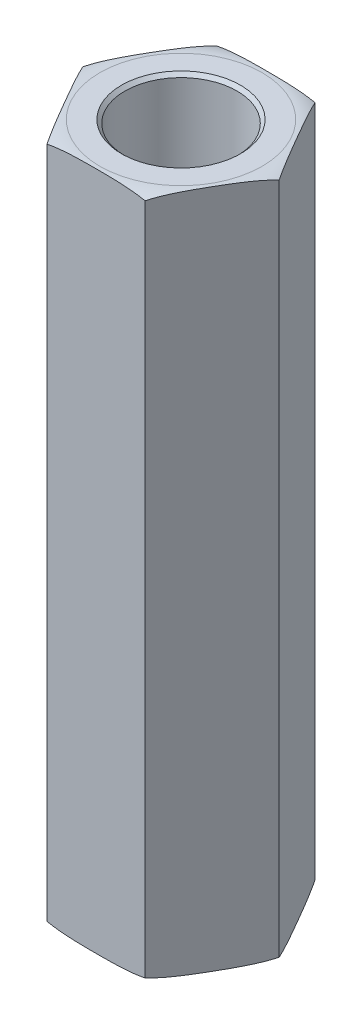
ISO-10303-21;
HEADER;
FILE_DESCRIPTION(('STEP AP214'),'2;1');
FILE_NAME('part.step','',(''),(''),'','','');
FILE_SCHEMA(('AUTOMOTIVE_DESIGN { 1 0 10303 214 1 1 1 1 }'));
ENDSEC;
DATA;
#1=APPLICATION_CONTEXT('core data for automotive mechanical design processes');
#2=APPLICATION_PROTOCOL_DEFINITION('international standard','automotive_design',2000,#1);
#3=PRODUCT_CONTEXT('',#1,'mechanical');
#4=PRODUCT('Part','Part','',(#3));
#5=PRODUCT_RELATED_PRODUCT_CATEGORY('part','',(#4));
#6=PRODUCT_DEFINITION_FORMATION('','',#4);
#7=PRODUCT_DEFINITION_CONTEXT('part definition',#1,'design');
#8=PRODUCT_DEFINITION('design','',#6,#7);
#9=PRODUCT_DEFINITION_SHAPE('','',#8);
#10=(LENGTH_UNIT() NAMED_UNIT(*) SI_UNIT(.MILLI.,.METRE.));
#11=(NAMED_UNIT(*) PLANE_ANGLE_UNIT() SI_UNIT($,.RADIAN.));
#12=(NAMED_UNIT(*) SI_UNIT($,.STERADIAN.) SOLID_ANGLE_UNIT());
#13=UNCERTAINTY_MEASURE_WITH_UNIT(LENGTH_MEASURE(1.E-05),#10,'distance_accuracy_value','');
#14=(GEOMETRIC_REPRESENTATION_CONTEXT(3) GLOBAL_UNCERTAINTY_ASSIGNED_CONTEXT((#13)) GLOBAL_UNIT_ASSIGNED_CONTEXT((#10,
#11,#12)) REPRESENTATION_CONTEXT('',''));
#15=CARTESIAN_POINT('',(0.,0.,0.));
#16=DIRECTION('',(0.,0.,1.));
#17=DIRECTION('',(1.,0.,0.));
#18=AXIS2_PLACEMENT_3D('',#15,#16,#17);
#19=CARTESIAN_POINT('',(3.66617420935412,12.7,0.));
#20=DIRECTION('',(-0.866025403784439,0.,0.5));
#21=DIRECTION('',(0.5,0.,0.866025403784439));
#22=AXIS2_PLACEMENT_3D('',#19,#20,#21);
#23=PLANE('',#22);
#24=DIRECTION('',(0.,1.,0.));
#25=VECTOR('',#24,1.);
#26=CARTESIAN_POINT('',(1.83308710467704,12.7,-3.175));
#27=LINE('',#26,#25);
#28=CARTESIAN_POINT('',(1.83308710467705,-12.573,-3.175));
#29=VERTEX_POINT('',#28);
#30=CARTESIAN_POINT('',(1.83308710467706,12.573,-3.175));
#31=VERTEX_POINT('',#30);
#32=EDGE_CURVE('E143',#29,#31,#27,.T.);
#33=ORIENTED_EDGE('',*,*,#32,.T.);
#34=CARTESIAN_POINT('',(3.66617420935412,12.573,0.));
#35=CARTESIAN_POINT('',(3.62797961467394,12.5889014148997,-0.0661549785605585));
#36=CARTESIAN_POINT('',(3.58956810864157,12.6024886076105,-0.132685658603878));
#37=CARTESIAN_POINT('',(3.5124905179571,12.6258161979402,-0.266187961794366));
#38=CARTESIAN_POINT('',(3.47382473049846,12.6355604771397,-0.333159070187399));
#39=CARTESIAN_POINT('',(3.39641631867872,12.6519966530451,-0.467234372392395));
#40=CARTESIAN_POINT('',(3.35767399633311,12.6586945328669,-0.534338043098201));
#41=CARTESIAN_POINT('',(3.28009834620112,12.6697767572932,-0.668703010557003));
#42=CARTESIAN_POINT('',(3.2412649958777,12.674160450474,-0.735964346345292));
#43=CARTESIAN_POINT('',(3.16354065964313,12.6812403004263,-0.870586845688127));
#44=CARTESIAN_POINT('',(3.12464965374474,12.6839355237591,-0.9379480438616));
#45=CARTESIAN_POINT('',(3.04685144594591,12.6881531983713,-1.07269849250698));
#46=CARTESIAN_POINT('',(3.00794424351967,12.6896756080272,-1.14008774388959));
#47=CARTESIAN_POINT('',(2.93051517598871,12.691922705889,-1.2741988228359));
#48=CARTESIAN_POINT('',(2.89199336248932,12.6926552468181,-1.34092056101654));
#49=CARTESIAN_POINT('',(2.8149477834614,12.6935767302574,-1.47436741839144));
#50=CARTESIAN_POINT('',(2.77642401791436,12.6937656658949,-1.5410925376178));
#51=CARTESIAN_POINT('',(2.69935964431009,12.6936659966806,-1.67457194815386));
#52=CARTESIAN_POINT('',(2.66081903631818,12.6933771811766,-1.74132623935045));
#53=CARTESIAN_POINT('',(2.58373908085326,12.692221986219,-1.87483263846084));
#54=CARTESIAN_POINT('',(2.54519973341241,12.6913555970386,-1.94158474631893));
#55=CARTESIAN_POINT('',(2.46812969629766,12.6887861940656,-2.0750739663429));
#56=CARTESIAN_POINT('',(2.42959900625961,12.6870832271617,-2.1418110791395));
#57=CARTESIAN_POINT('',(2.35255651340904,12.6824387229726,-2.27525259109845));
#58=CARTESIAN_POINT('',(2.31404470975438,12.6794972471358,-2.34195699171943));
#59=CARTESIAN_POINT('',(2.2508420623994,12.6732174124749,-2.45142718811111));
#60=CARTESIAN_POINT('',(2.22613849337005,12.6703980110463,-2.49421502479823));
#61=CARTESIAN_POINT('',(2.17676945272224,12.6638696794304,-2.57972471152118));
#62=CARTESIAN_POINT('',(2.1521039703418,12.6601610809139,-2.6224465801973));
#63=CARTESIAN_POINT('',(2.10282753811693,12.6516802711497,-2.7077958644265));
#64=CARTESIAN_POINT('',(2.07821657107526,12.6469084657008,-2.75042330976607));
#65=CARTESIAN_POINT('',(2.02900094683547,12.6360987712516,-2.8356672714756));
#66=CARTESIAN_POINT('',(2.00439646085461,12.6300577313084,-2.87828349128856));
#67=CARTESIAN_POINT('',(1.95527325900932,12.6165138354161,-2.96336737271507));
#68=CARTESIAN_POINT('',(1.93075459617613,12.609010197803,-3.00583494247581));
#69=CARTESIAN_POINT('',(1.8818215737317,12.5923203507084,-3.09058942351746));
#70=CARTESIAN_POINT('',(1.85740744053269,12.5831314978033,-3.13287594264091));
#71=CARTESIAN_POINT('',(1.83308710467706,12.573,-3.175));
#72=B_SPLINE_CURVE_WITH_KNOTS('',3,(#34,#35,#36,#37,#38,#39,#40,#41,#42,#43,#44,#45,#46,#47,#48,
#49,#50,#51,#52,#53,#54,#55,#56,#57,#58,#59,#60,#61,#62,#63,#64,#65,#66,#67,#68,#69,#70,#71),
.UNSPECIFIED.,.F.,.F.,(4,2,2,2,2,2,2,2,2,2,2,2,2,2,2,2,2,2,4),(0.,0.233977307817949,
0.467717675040708,0.700996973557522,0.934341903229779,1.16781571967243,1.40129782179829,
1.63243665809675,1.86357841666623,2.09482211846301,2.32606971471502,2.55730435147406,
2.78852751694422,2.93698369265095,3.0853845800448,3.23372892334589,3.38244598546616,
3.53124274626086,3.68027493713586),.UNSPECIFIED.);
#73=CARTESIAN_POINT('',(3.66617420935412,12.573,0.));
#74=VERTEX_POINT('',#73);
#75=EDGE_CURVE('E95',#74,#31,#72,.T.);
#76=ORIENTED_EDGE('',*,*,#75,.F.);
#77=DIRECTION('',(0.,1.,0.));
#78=VECTOR('',#77,1.);
#79=CARTESIAN_POINT('',(3.66617420935412,12.7,0.));
#80=LINE('',#79,#78);
#81=CARTESIAN_POINT('',(3.66617420935412,-12.573,0.));
#82=VERTEX_POINT('',#81);
#83=EDGE_CURVE('E145',#74,#82,#80,.F.);
#84=ORIENTED_EDGE('',*,*,#83,.T.);
#85=CARTESIAN_POINT('',(1.83308710467705,-12.573,-3.17500000000001));
#86=CARTESIAN_POINT('',(1.87128169935723,-12.5889014148997,-3.10884502143945));
#87=CARTESIAN_POINT('',(1.9096932053896,-12.6024886076105,-3.04231434139613));
#88=CARTESIAN_POINT('',(1.98677079607407,-12.6258161979402,-2.90881203820565));
#89=CARTESIAN_POINT('',(2.02543658353271,-12.6355604771397,-2.84184092981261));
#90=CARTESIAN_POINT('',(2.10284499535244,-12.6519966530451,-2.70776562760762));
#91=CARTESIAN_POINT('',(2.14158731769805,-12.6586945328669,-2.64066195690182));
#92=CARTESIAN_POINT('',(2.21916296783004,-12.6697767572932,-2.50629698944302));
#93=CARTESIAN_POINT('',(2.25799631815347,-12.674160450474,-2.43903565365473));
#94=CARTESIAN_POINT('',(2.33572065438803,-12.6812403004263,-2.3044131543119));
#95=CARTESIAN_POINT('',(2.37461166028642,-12.6839355237591,-2.23705195613842));
#96=CARTESIAN_POINT('',(2.45240986808525,-12.6881531983713,-2.10230150749305));
#97=CARTESIAN_POINT('',(2.49131707051149,-12.6896756080272,-2.03491225611044));
#98=CARTESIAN_POINT('',(2.56874613804245,-12.691922705889,-1.90080117716413));
#99=CARTESIAN_POINT('',(2.60726795154184,-12.6926552468181,-1.8340794389835));
#100=CARTESIAN_POINT('',(2.68431353056975,-12.6935767302574,-1.70063258160859));
#101=CARTESIAN_POINT('',(2.72283729611679,-12.6937656658949,-1.63390746238224));
#102=CARTESIAN_POINT('',(2.79990166972106,-12.6936659966806,-1.50042805184618));
#103=CARTESIAN_POINT('',(2.83844227771297,-12.6933771811766,-1.43367376064959));
#104=CARTESIAN_POINT('',(2.91552223317789,-12.692221986219,-1.30016736153921));
#105=CARTESIAN_POINT('',(2.95406158061874,-12.6913555970386,-1.23341525368111));
#106=CARTESIAN_POINT('',(3.03113161773348,-12.6887861940656,-1.09992603365715));
#107=CARTESIAN_POINT('',(3.06966230777154,-12.6870832271617,-1.03318892086055));
#108=CARTESIAN_POINT('',(3.14670480062211,-12.6824387229726,-0.899747408901607));
#109=CARTESIAN_POINT('',(3.18521660427677,-12.6794972471358,-0.833043008280621));
#110=CARTESIAN_POINT('',(3.24841925163175,-12.6732174124749,-0.723572811888938));
#111=CARTESIAN_POINT('',(3.27312282066109,-12.6703980110463,-0.680784975201824));
#112=CARTESIAN_POINT('',(3.32249186130891,-12.6638696794304,-0.595275288478867));
#113=CARTESIAN_POINT('',(3.34715734368935,-12.6601610809139,-0.552553419802744));
#114=CARTESIAN_POINT('',(3.39643377591423,-12.6516802711497,-0.467204135573539));
#115=CARTESIAN_POINT('',(3.4210447429559,-12.6469084657008,-0.424576690233965));
#116=CARTESIAN_POINT('',(3.47026036719569,-12.6360987712516,-0.339332728524428));
#117=CARTESIAN_POINT('',(3.49486485317655,-12.6300577313084,-0.296716508711459));
#118=CARTESIAN_POINT('',(3.54398805502185,-12.6165138354161,-0.211632627284942));
#119=CARTESIAN_POINT('',(3.56850671785504,-12.609010197803,-0.169165057524202));
#120=CARTESIAN_POINT('',(3.61743974029947,-12.5923203507084,-0.0844105764825456));
#121=CARTESIAN_POINT('',(3.64185387349848,-12.5831314978033,-0.0421240573590982));
#122=CARTESIAN_POINT('',(3.66617420935412,-12.573,0.));
#123=B_SPLINE_CURVE_WITH_KNOTS('',3,(#85,#86,#87,#88,#89,#90,#91,#92,#93,#94,#95,#96,#97,#98,
#99,#100,#101,#102,#103,#104,#105,#106,#107,#108,#109,#110,#111,#112,#113,#114,#115,#116,#117,
#118,#119,#120,#121,#122),.UNSPECIFIED.,.F.,.F.,(4,2,2,2,2,2,2,2,2,2,2,2,2,2,2,2,2,2,4),(0.,
0.233977307817944,0.467717675040699,0.700996973557508,0.934341903229761,1.16781571967241,
1.40129782179826,1.63243665809671,1.86357841666619,2.09482211846297,2.32606971471497,
2.55730435147401,2.78852751694416,2.9369836926509,3.08538458004476,3.23372892334587,
3.38244598546614,3.53124274626085,3.68027493713586),.UNSPECIFIED.);
#124=EDGE_CURVE('E223',#29,#82,#123,.T.);
#125=ORIENTED_EDGE('',*,*,#124,.F.);
#126=EDGE_LOOP('',(#33,#76,#84,#125));
#127=FACE_BOUND('',#126,.T.);
#128=ADVANCED_FACE('F15',(#127),#23,.F.);
#129=CARTESIAN_POINT('',(1.83308710467706,12.7,3.17499999999999));
#130=DIRECTION('',(-0.866025403784439,0.,-0.5));
#131=DIRECTION('',(-0.5,0.,0.866025403784439));
#132=AXIS2_PLACEMENT_3D('',#129,#130,#131);
#133=PLANE('',#132);
#134=ORIENTED_EDGE('',*,*,#83,.F.);
#135=CARTESIAN_POINT('',(1.83308710467706,12.573,3.17499999999999));
#136=CARTESIAN_POINT('',(1.87128169935724,12.5889014148997,3.10884502143943));
#137=CARTESIAN_POINT('',(1.90969320538962,12.6024886076105,3.04231434139611));
#138=CARTESIAN_POINT('',(1.98677079607408,12.6258161979402,2.90881203820562));
#139=CARTESIAN_POINT('',(2.02543658353273,12.6355604771397,2.84184092981259));
#140=CARTESIAN_POINT('',(2.10284499535246,12.6519966530451,2.7077656276076));
#141=CARTESIAN_POINT('',(2.14158731769807,12.6586945328669,2.64066195690179));
#142=CARTESIAN_POINT('',(2.21916296783006,12.6697767572932,2.50629698944299));
#143=CARTESIAN_POINT('',(2.25799631815349,12.674160450474,2.4390356536547));
#144=CARTESIAN_POINT('',(2.33572065438805,12.6812403004263,2.30441315431186));
#145=CARTESIAN_POINT('',(2.37461166028644,12.6839355237591,2.23705195613839));
#146=CARTESIAN_POINT('',(2.45240986808528,12.6881531983713,2.10230150749301));
#147=CARTESIAN_POINT('',(2.49131707051151,12.6896756080272,2.0349122561104));
#148=CARTESIAN_POINT('',(2.56874613804248,12.691922705889,1.90080117716409));
#149=CARTESIAN_POINT('',(2.60726795154187,12.6926552468181,1.83407943898345));
#150=CARTESIAN_POINT('',(2.68431353056978,12.6935767302574,1.70063258160855));
#151=CARTESIAN_POINT('',(2.72283729611682,12.6937656658949,1.63390746238219));
#152=CARTESIAN_POINT('',(2.79990166972109,12.6936659966806,1.50042805184613));
#153=CARTESIAN_POINT('',(2.83844227771301,12.6933771811766,1.43367376064954));
#154=CARTESIAN_POINT('',(2.91552223317792,12.692221986219,1.30016736153915));
#155=CARTESIAN_POINT('',(2.95406158061877,12.6913555970386,1.23341525368106));
#156=CARTESIAN_POINT('',(3.03113161773352,12.6887861940656,1.09992603365709));
#157=CARTESIAN_POINT('',(3.06966230777158,12.6870832271617,1.03318892086049));
#158=CARTESIAN_POINT('',(3.14670480062214,12.6824387229726,0.899747408901544));
#159=CARTESIAN_POINT('',(3.1852166042768,12.6794972471358,0.833043008280556));
#160=CARTESIAN_POINT('',(3.24841925163178,12.6732174124749,0.723572811888876));
#161=CARTESIAN_POINT('',(3.27312282066113,12.6703980110463,0.680784975201767));
#162=CARTESIAN_POINT('',(3.32249186130894,12.6638696794304,0.595275288478818));
#163=CARTESIAN_POINT('',(3.34715734368938,12.6601610809139,0.552553419802699));
#164=CARTESIAN_POINT('',(3.39643377591425,12.6516802711497,0.467204135573501));
#165=CARTESIAN_POINT('',(3.42104474295592,12.6469084657008,0.424576690233932));
#166=CARTESIAN_POINT('',(3.47026036719571,12.6360987712516,0.339332728524402));
#167=CARTESIAN_POINT('',(3.49486485317657,12.6300577313084,0.296716508711437));
#168=CARTESIAN_POINT('',(3.54398805502186,12.6165138354161,0.211632627284927));
#169=CARTESIAN_POINT('',(3.56850671785505,12.609010197803,0.169165057524192));
#170=CARTESIAN_POINT('',(3.61743974029947,12.5923203507084,0.0844105764825436));
#171=CARTESIAN_POINT('',(3.64185387349848,12.5831314978033,0.0421240573591002));
#172=CARTESIAN_POINT('',(3.66617420935412,12.573,0.));
#173=B_SPLINE_CURVE_WITH_KNOTS('',3,(#135,#136,#137,#138,#139,#140,#141,#142,#143,#144,#145,
#146,#147,#148,#149,#150,#151,#152,#153,#154,#155,#156,#157,#158,#159,#160,#161,#162,#163,#164,
#165,#166,#167,#168,#169,#170,#171,#172),.UNSPECIFIED.,.F.,.F.,(4,2,2,2,2,2,2,2,2,2,2,2,2,2,2,2,
2,2,4),(0.,0.23397730781795,0.467717675040709,0.700996973557522,0.93434190322978,
1.16781571967243,1.40129782179829,1.63243665809675,1.86357841666623,2.09482211846301,
2.32606971471502,2.55730435147406,2.78852751694422,2.93698369265095,3.08538458004479,
3.23372892334589,3.38244598546615,3.53124274626085,3.68027493713584),.UNSPECIFIED.);
#174=CARTESIAN_POINT('',(1.83308710467706,12.573,3.17499999999999));
#175=VERTEX_POINT('',#174);
#176=EDGE_CURVE('E216',#175,#74,#173,.T.);
#177=ORIENTED_EDGE('',*,*,#176,.F.);
#178=DIRECTION('',(0.,1.,0.));
#179=VECTOR('',#178,1.);
#180=CARTESIAN_POINT('',(1.83308710467706,12.7,3.17499999999999));
#181=LINE('',#180,#179);
#182=CARTESIAN_POINT('',(1.83308710467706,-12.573,3.17499999999999));
#183=VERTEX_POINT('',#182);
#184=EDGE_CURVE('E140',#175,#183,#181,.F.);
#185=ORIENTED_EDGE('',*,*,#184,.T.);
#186=CARTESIAN_POINT('',(3.66617420935412,-12.573,0.));
#187=CARTESIAN_POINT('',(3.62797961467394,-12.5889014148997,0.0661549785605638));
#188=CARTESIAN_POINT('',(3.58956810864156,-12.6024886076105,0.132685658603883));
#189=CARTESIAN_POINT('',(3.5124905179571,-12.6258161979402,0.266187961794371));
#190=CARTESIAN_POINT('',(3.47382473049846,-12.6355604771397,0.333159070187405));
#191=CARTESIAN_POINT('',(3.39641631867872,-12.6519966530451,0.467234372392401));
#192=CARTESIAN_POINT('',(3.35767399633311,-12.6586945328669,0.534338043098206));
#193=CARTESIAN_POINT('',(3.28009834620112,-12.6697767572932,0.668703010557008));
#194=CARTESIAN_POINT('',(3.2412649958777,-12.674160450474,0.735964346345298));
#195=CARTESIAN_POINT('',(3.16354065964313,-12.6812403004263,0.870586845688132));
#196=CARTESIAN_POINT('',(3.12464965374474,-12.6839355237591,0.937948043861606));
#197=CARTESIAN_POINT('',(3.0468514459459,-12.6881531983713,1.07269849250699));
#198=CARTESIAN_POINT('',(3.00794424351967,-12.6896756080272,1.1400877438896));
#199=CARTESIAN_POINT('',(2.9305151759887,-12.691922705889,1.27419882283591));
#200=CARTESIAN_POINT('',(2.89199336248931,-12.6926552468181,1.34092056101654));
#201=CARTESIAN_POINT('',(2.8149477834614,-12.6935767302574,1.47436741839145));
#202=CARTESIAN_POINT('',(2.77642401791436,-12.6937656658949,1.5410925376178));
#203=CARTESIAN_POINT('',(2.69935964431009,-12.6936659966806,1.67457194815387));
#204=CARTESIAN_POINT('',(2.66081903631818,-12.6933771811766,1.74132623935046));
#205=CARTESIAN_POINT('',(2.58373908085326,-12.692221986219,1.87483263846084));
#206=CARTESIAN_POINT('',(2.54519973341241,-12.6913555970386,1.94158474631894));
#207=CARTESIAN_POINT('',(2.46812969629766,-12.6887861940656,2.0750739663429));
#208=CARTESIAN_POINT('',(2.4295990062596,-12.6870832271616,2.14181107913951));
#209=CARTESIAN_POINT('',(2.35255651340904,-12.6824387229726,2.27525259109845));
#210=CARTESIAN_POINT('',(2.31404470975437,-12.6794972471358,2.34195699171944));
#211=CARTESIAN_POINT('',(2.2508420623994,-12.6732174124749,2.45142718811112));
#212=CARTESIAN_POINT('',(2.22613849337005,-12.6703980110463,2.49421502479823));
#213=CARTESIAN_POINT('',(2.17676945272224,-12.6638696794304,2.57972471152118));
#214=CARTESIAN_POINT('',(2.1521039703418,-12.6601610809139,2.6224465801973));
#215=CARTESIAN_POINT('',(2.10282753811693,-12.6516802711497,2.7077958644265));
#216=CARTESIAN_POINT('',(2.07821657107526,-12.6469084657008,2.75042330976606));
#217=CARTESIAN_POINT('',(2.02900094683548,-12.6360987712516,2.83566727147559));
#218=CARTESIAN_POINT('',(2.00439646085462,-12.6300577313084,2.87828349128856));
#219=CARTESIAN_POINT('',(1.95527325900932,-12.6165138354161,2.96336737271507));
#220=CARTESIAN_POINT('',(1.93075459617613,-12.609010197803,3.0058349424758));
#221=CARTESIAN_POINT('',(1.88182157373171,-12.5923203507084,3.09058942351745));
#222=CARTESIAN_POINT('',(1.8574074405327,-12.5831314978033,3.1328759426409));
#223=CARTESIAN_POINT('',(1.83308710467706,-12.573,3.17499999999999));
#224=B_SPLINE_CURVE_WITH_KNOTS('',3,(#186,#187,#188,#189,#190,#191,#192,#193,#194,#195,#196,
#197,#198,#199,#200,#201,#202,#203,#204,#205,#206,#207,#208,#209,#210,#211,#212,#213,#214,#215,
#216,#217,#218,#219,#220,#221,#222,#223),.UNSPECIFIED.,.F.,.F.,(4,2,2,2,2,2,2,2,2,2,2,2,2,2,2,2,
2,2,4),(0.,0.233977307817949,0.467717675040709,0.700996973557522,0.93434190322978,
1.16781571967243,1.40129782179829,1.63243665809675,1.86357841666623,2.09482211846301,
2.32606971471502,2.55730435147406,2.78852751694422,2.93698369265095,3.08538458004479,
3.23372892334589,3.38244598546615,3.53124274626085,3.68027493713584),.UNSPECIFIED.);
#225=EDGE_CURVE('E245',#82,#183,#224,.T.);
#226=ORIENTED_EDGE('',*,*,#225,.F.);
#227=EDGE_LOOP('',(#134,#177,#185,#226));
#228=FACE_BOUND('',#227,.T.);
#229=ADVANCED_FACE('F220',(#228),#133,.F.);
#230=CARTESIAN_POINT('',(1.83308710467706,12.7,-3.175));
#231=DIRECTION('',(0.,0.,1.));
#232=DIRECTION('',(1.,0.,0.));
#233=AXIS2_PLACEMENT_3D('',#230,#231,#232);
#234=PLANE('',#233);
#235=DIRECTION('',(0.,1.,0.));
#236=VECTOR('',#235,1.);
#237=CARTESIAN_POINT('',(-1.83308710467707,12.7,-3.175));
#238=LINE('',#237,#236);
#239=CARTESIAN_POINT('',(-1.83308710467707,-12.573,-3.175));
#240=VERTEX_POINT('',#239);
#241=CARTESIAN_POINT('',(-1.83308710467706,12.573,-3.17500000000001));
#242=VERTEX_POINT('',#241);
#243=EDGE_CURVE('E102',#240,#242,#238,.T.);
#244=ORIENTED_EDGE('',*,*,#243,.T.);
#245=CARTESIAN_POINT('',(1.83308710467706,12.573,-3.175));
#246=CARTESIAN_POINT('',(1.73237579828683,12.5939400141518,-3.175));
#247=CARTESIAN_POINT('',(1.63096506893486,12.6108853495327,-3.175));
#248=CARTESIAN_POINT('',(1.42767146651469,12.6384971643984,-3.175));
#249=CARTESIAN_POINT('',(1.32579191427254,12.6491875658753,-3.175));
#250=CARTESIAN_POINT('',(1.12177634709137,12.6661280408079,-3.175));
#251=CARTESIAN_POINT('',(1.0196405664338,12.6723812707189,-3.175));
#252=CARTESIAN_POINT('',(0.815663681397375,12.6819028064183,-3.175));
#253=CARTESIAN_POINT('',(0.713823115514573,12.6851834044999,-3.175));
#254=CARTESIAN_POINT('',(0.510018485441651,12.6899454848703,-3.175));
#255=CARTESIAN_POINT('',(0.408054390577976,12.6914254100882,-3.175));
#256=CARTESIAN_POINT('',(0.20406020033787,12.6933146818379,-3.175));
#257=CARTESIAN_POINT('',(0.102030100168935,12.6937234241492,-3.175));
#258=CARTESIAN_POINT('',(-0.102030100168934,12.6937234241492,-3.175));
#259=CARTESIAN_POINT('',(-0.204060200337869,12.6933146818379,-3.175));
#260=CARTESIAN_POINT('',(-0.408054390577974,12.6914254100882,-3.175));
#261=CARTESIAN_POINT('',(-0.510018485441649,12.6899454848703,-3.175));
#262=CARTESIAN_POINT('',(-0.71382311551457,12.6851834044999,-3.175));
#263=CARTESIAN_POINT('',(-0.815663681397372,12.6819028064183,-3.175));
#264=CARTESIAN_POINT('',(-1.01964056643379,12.6723812707189,-3.175));
#265=CARTESIAN_POINT('',(-1.12177634709137,12.6661280408079,-3.175));
#266=CARTESIAN_POINT('',(-1.32579191427253,12.6491875658753,-3.175));
#267=CARTESIAN_POINT('',(-1.42767146651468,12.6384971643984,-3.175));
#268=CARTESIAN_POINT('',(-1.63096506893485,12.6108853495327,-3.175));
#269=CARTESIAN_POINT('',(-1.73237579828682,12.5939400141518,-3.175));
#270=CARTESIAN_POINT('',(-1.83308710467705,12.573,-3.175));
#271=B_SPLINE_CURVE_WITH_KNOTS('',3,(#245,#246,#247,#248,#249,#250,#251,#252,#253,#254,#255,
#256,#257,#258,#259,#260,#261,#262,#263,#264,#265,#266,#267,#268,#269,#270),.UNSPECIFIED.,.F.,
.F.,(4,2,2,2,2,2,2,2,2,2,2,2,4),(0.,0.308333242342807,0.615479423308234,0.922406891130008,
1.2280592962085,1.53397581645216,1.84006485747889,2.14615389850561,2.45207041874927,
2.75772282382776,3.06465029164953,3.37179647261496,3.68012971495777),.UNSPECIFIED.);
#272=EDGE_CURVE('E87',#31,#242,#271,.T.);
#273=ORIENTED_EDGE('',*,*,#272,.F.);
#274=ORIENTED_EDGE('',*,*,#32,.F.);
#275=CARTESIAN_POINT('',(-1.83308710467707,-12.573,-3.175));
#276=CARTESIAN_POINT('',(-1.73237579828684,-12.5939400141518,-3.175));
#277=CARTESIAN_POINT('',(-1.63096506893487,-12.6108853495327,-3.175));
#278=CARTESIAN_POINT('',(-1.4276714665147,-12.6384971643984,-3.175));
#279=CARTESIAN_POINT('',(-1.32579191427255,-12.6491875658753,-3.175));
#280=CARTESIAN_POINT('',(-1.12177634709138,-12.6661280408079,-3.175));
#281=CARTESIAN_POINT('',(-1.0196405664338,-12.6723812707189,-3.175));
#282=CARTESIAN_POINT('',(-0.81566368139738,-12.6819028064183,-3.175));
#283=CARTESIAN_POINT('',(-0.713823115514577,-12.6851834044999,-3.175));
#284=CARTESIAN_POINT('',(-0.510018485441653,-12.6899454848703,-3.175));
#285=CARTESIAN_POINT('',(-0.408054390577979,-12.6914254100882,-3.175));
#286=CARTESIAN_POINT('',(-0.204060200337872,-12.6933146818379,-3.175));
#287=CARTESIAN_POINT('',(-0.102030100168936,-12.6937234241492,-3.175));
#288=CARTESIAN_POINT('',(0.102030100168934,-12.6937234241492,-3.175));
#289=CARTESIAN_POINT('',(0.204060200337868,-12.6933146818379,-3.175));
#290=CARTESIAN_POINT('',(0.408054390577973,-12.6914254100882,-3.175));
#291=CARTESIAN_POINT('',(0.510018485441647,-12.6899454848703,-3.175));
#292=CARTESIAN_POINT('',(0.713823115514568,-12.6851834044999,-3.175));
#293=CARTESIAN_POINT('',(0.81566368139737,-12.6819028064183,-3.175));
#294=CARTESIAN_POINT('',(1.01964056643379,-12.6723812707189,-3.175));
#295=CARTESIAN_POINT('',(1.12177634709137,-12.6661280408079,-3.175));
#296=CARTESIAN_POINT('',(1.32579191427253,-12.6491875658753,-3.175));
#297=CARTESIAN_POINT('',(1.42767146651468,-12.6384971643984,-3.175));
#298=CARTESIAN_POINT('',(1.63096506893485,-12.6108853495327,-3.175));
#299=CARTESIAN_POINT('',(1.73237579828682,-12.5939400141518,-3.175));
#300=CARTESIAN_POINT('',(1.83308710467705,-12.573,-3.175));
#301=B_SPLINE_CURVE_WITH_KNOTS('',3,(#275,#276,#277,#278,#279,#280,#281,#282,#283,#284,#285,
#286,#287,#288,#289,#290,#291,#292,#293,#294,#295,#296,#297,#298,#299,#300),.UNSPECIFIED.,.F.,
.F.,(4,2,2,2,2,2,2,2,2,2,2,2,4),(0.,0.308333242342808,0.615479423308238,0.922406891130013,
1.22805929620851,1.53397581645217,1.8400648574789,2.14615389850562,2.45207041874928,
2.75772282382777,3.06465029164954,3.37179647261497,3.68012971495777),.UNSPECIFIED.);
#302=EDGE_CURVE('E104',#240,#29,#301,.T.);
#303=ORIENTED_EDGE('',*,*,#302,.F.);
#304=EDGE_LOOP('',(#244,#273,#274,#303));
#305=FACE_BOUND('',#304,.T.);
#306=ADVANCED_FACE('F103',(#305),#234,.F.);
#307=CARTESIAN_POINT('',(-1.83308710467707,12.7,3.175));
#308=DIRECTION('',(0.,0.,-1.));
#309=DIRECTION('',(-1.,0.,0.));
#310=AXIS2_PLACEMENT_3D('',#307,#308,#309);
#311=PLANE('',#310);
#312=ORIENTED_EDGE('',*,*,#184,.F.);
#313=CARTESIAN_POINT('',(-1.83308710467706,12.573,3.175));
#314=CARTESIAN_POINT('',(-1.73237579828684,12.5939400141518,3.175));
#315=CARTESIAN_POINT('',(-1.63096506893486,12.6108853495327,3.175));
#316=CARTESIAN_POINT('',(-1.42767146651469,12.6384971643984,3.175));
#317=CARTESIAN_POINT('',(-1.32579191427254,12.6491875658753,3.175));
#318=CARTESIAN_POINT('',(-1.12177634709138,12.6661280408079,3.175));
#319=CARTESIAN_POINT('',(-1.0196405664338,12.6723812707189,3.175));
#320=CARTESIAN_POINT('',(-0.815663681397378,12.6819028064183,3.175));
#321=CARTESIAN_POINT('',(-0.713823115514575,12.6851834044999,3.175));
#322=CARTESIAN_POINT('',(-0.510018485441652,12.6899454848703,3.175));
#323=CARTESIAN_POINT('',(-0.408054390577977,12.6914254100882,3.175));
#324=CARTESIAN_POINT('',(-0.204060200337871,12.6933146818379,3.175));
#325=CARTESIAN_POINT('',(-0.102030100168935,12.6937234241492,3.17499999999999));
#326=CARTESIAN_POINT('',(0.102030100168935,12.6937234241492,3.17499999999999));
#327=CARTESIAN_POINT('',(0.204060200337871,12.6933146818379,3.17499999999999));
#328=CARTESIAN_POINT('',(0.408054390577978,12.6914254100882,3.17499999999999));
#329=CARTESIAN_POINT('',(0.510018485441652,12.6899454848703,3.17499999999999));
#330=CARTESIAN_POINT('',(0.713823115514575,12.6851834044999,3.17499999999999));
#331=CARTESIAN_POINT('',(0.815663681397378,12.6819028064183,3.17499999999999));
#332=CARTESIAN_POINT('',(1.0196405664338,12.6723812707189,3.17499999999999));
#333=CARTESIAN_POINT('',(1.12177634709138,12.6661280408079,3.17499999999999));
#334=CARTESIAN_POINT('',(1.32579191427254,12.6491875658753,3.17499999999999));
#335=CARTESIAN_POINT('',(1.42767146651469,12.6384971643984,3.17499999999999));
#336=CARTESIAN_POINT('',(1.63096506893486,12.6108853495327,3.17499999999999));
#337=CARTESIAN_POINT('',(1.73237579828684,12.5939400141518,3.17499999999999));
#338=CARTESIAN_POINT('',(1.83308710467706,12.573,3.17499999999999));
#339=B_SPLINE_CURVE_WITH_KNOTS('',3,(#313,#314,#315,#316,#317,#318,#319,#320,#321,#322,#323,
#324,#325,#326,#327,#328,#329,#330,#331,#332,#333,#334,#335,#336,#337,#338),.UNSPECIFIED.,.F.,
.F.,(4,2,2,2,2,2,2,2,2,2,2,2,4),(0.,0.308333242342808,0.615479423308237,0.922406891130011,
1.2280592962085,1.53397581645216,1.84006485747889,2.14615389850562,2.45207041874928,
2.75772282382777,3.06465029164955,3.37179647261498,3.68012971495779),.UNSPECIFIED.);
#340=CARTESIAN_POINT('',(-1.83308710467707,12.573,3.175));
#341=VERTEX_POINT('',#340);
#342=EDGE_CURVE('E98',#341,#175,#339,.T.);
#343=ORIENTED_EDGE('',*,*,#342,.F.);
#344=DIRECTION('',(0.,1.,0.));
#345=VECTOR('',#344,1.);
#346=CARTESIAN_POINT('',(-1.83308710467707,12.7,3.175));
#347=LINE('',#346,#345);
#348=CARTESIAN_POINT('',(-1.83308710467706,-12.573,3.175));
#349=VERTEX_POINT('',#348);
#350=EDGE_CURVE('E106',#341,#349,#347,.F.);
#351=ORIENTED_EDGE('',*,*,#350,.T.);
#352=CARTESIAN_POINT('',(1.83308710467706,-12.573,3.17499999999999));
#353=CARTESIAN_POINT('',(1.73237579828684,-12.5939400141518,3.17499999999999));
#354=CARTESIAN_POINT('',(1.63096506893486,-12.6108853495327,3.17499999999999));
#355=CARTESIAN_POINT('',(1.4276714665147,-12.6384971643984,3.17499999999999));
#356=CARTESIAN_POINT('',(1.32579191427254,-12.6491875658753,3.17499999999999));
#357=CARTESIAN_POINT('',(1.12177634709138,-12.6661280408079,3.17499999999999));
#358=CARTESIAN_POINT('',(1.0196405664338,-12.6723812707189,3.17499999999999));
#359=CARTESIAN_POINT('',(0.815663681397379,-12.6819028064183,3.17499999999999));
#360=CARTESIAN_POINT('',(0.713823115514576,-12.6851834044999,3.17499999999999));
#361=CARTESIAN_POINT('',(0.510018485441653,-12.6899454848703,3.17499999999999));
#362=CARTESIAN_POINT('',(0.408054390577978,-12.6914254100882,3.17499999999999));
#363=CARTESIAN_POINT('',(0.204060200337871,-12.6933146818379,3.17499999999999));
#364=CARTESIAN_POINT('',(0.102030100168935,-12.6937234241492,3.17499999999999));
#365=CARTESIAN_POINT('',(-0.102030100168935,-12.6937234241492,3.17499999999999));
#366=CARTESIAN_POINT('',(-0.204060200337871,-12.6933146818379,3.175));
#367=CARTESIAN_POINT('',(-0.408054390577977,-12.6914254100882,3.175));
#368=CARTESIAN_POINT('',(-0.510018485441652,-12.6899454848703,3.175));
#369=CARTESIAN_POINT('',(-0.713823115514575,-12.6851834044999,3.175));
#370=CARTESIAN_POINT('',(-0.815663681397377,-12.6819028064183,3.175));
#371=CARTESIAN_POINT('',(-1.0196405664338,-12.6723812707189,3.175));
#372=CARTESIAN_POINT('',(-1.12177634709138,-12.6661280408079,3.175));
#373=CARTESIAN_POINT('',(-1.32579191427254,-12.6491875658753,3.175));
#374=CARTESIAN_POINT('',(-1.42767146651469,-12.6384971643984,3.175));
#375=CARTESIAN_POINT('',(-1.63096506893486,-12.6108853495327,3.175));
#376=CARTESIAN_POINT('',(-1.73237579828684,-12.5939400141518,3.175));
#377=CARTESIAN_POINT('',(-1.83308710467706,-12.573,3.175));
#378=B_SPLINE_CURVE_WITH_KNOTS('',3,(#352,#353,#354,#355,#356,#357,#358,#359,#360,#361,#362,
#363,#364,#365,#366,#367,#368,#369,#370,#371,#372,#373,#374,#375,#376,#377),.UNSPECIFIED.,.F.,
.F.,(4,2,2,2,2,2,2,2,2,2,2,2,4),(0.,0.308333242342808,0.615479423308237,0.922406891130012,
1.22805929620851,1.53397581645217,1.84006485747889,2.14615389850562,2.45207041874928,
2.75772282382777,3.06465029164955,3.37179647261498,3.68012971495779),.UNSPECIFIED.);
#379=EDGE_CURVE('E210',#183,#349,#378,.T.);
#380=ORIENTED_EDGE('',*,*,#379,.F.);
#381=EDGE_LOOP('',(#312,#343,#351,#380));
#382=FACE_BOUND('',#381,.T.);
#383=ADVANCED_FACE('F378',(#382),#311,.F.);
#384=CARTESIAN_POINT('',(-3.66617420935413,12.7,0.));
#385=DIRECTION('',(0.866025403784439,0.,-0.499999999999999));
#386=DIRECTION('',(-0.499999999999999,0.,-0.866025403784439));
#387=AXIS2_PLACEMENT_3D('',#384,#385,#386);
#388=PLANE('',#387);
#389=ORIENTED_EDGE('',*,*,#350,.F.);
#390=CARTESIAN_POINT('',(-3.66617420935412,12.573,0.));
#391=CARTESIAN_POINT('',(-3.62797961467395,12.5889014148997,0.0661549785605641));
#392=CARTESIAN_POINT('',(-3.58956810864157,12.6024886076105,0.132685658603883));
#393=CARTESIAN_POINT('',(-3.51249051795711,12.6258161979402,0.266187961794371));
#394=CARTESIAN_POINT('',(-3.47382473049846,12.6355604771397,0.333159070187405));
#395=CARTESIAN_POINT('',(-3.39641631867873,12.6519966530451,0.4672343723924));
#396=CARTESIAN_POINT('',(-3.35767399633312,12.6586945328669,0.534338043098206));
#397=CARTESIAN_POINT('',(-3.28009834620112,12.6697767572932,0.668703010557008));
#398=CARTESIAN_POINT('',(-3.2412649958777,12.674160450474,0.735964346345298));
#399=CARTESIAN_POINT('',(-3.16354065964313,12.6812403004263,0.870586845688132));
#400=CARTESIAN_POINT('',(-3.12464965374474,12.6839355237591,0.937948043861606));
#401=CARTESIAN_POINT('',(-3.04685144594591,12.6881531983713,1.07269849250699));
#402=CARTESIAN_POINT('',(-3.00794424351967,12.6896756080272,1.1400877438896));
#403=CARTESIAN_POINT('',(-2.93051517598871,12.691922705889,1.27419882283591));
#404=CARTESIAN_POINT('',(-2.89199336248932,12.6926552468181,1.34092056101654));
#405=CARTESIAN_POINT('',(-2.81494778346141,12.6935767302574,1.47436741839145));
#406=CARTESIAN_POINT('',(-2.77642401791437,12.6937656658949,1.5410925376178));
#407=CARTESIAN_POINT('',(-2.69935964431009,12.6936659966806,1.67457194815387));
#408=CARTESIAN_POINT('',(-2.66081903631818,12.6933771811766,1.74132623935046));
#409=CARTESIAN_POINT('',(-2.58373908085326,12.692221986219,1.87483263846084));
#410=CARTESIAN_POINT('',(-2.54519973341242,12.6913555970386,1.94158474631894));
#411=CARTESIAN_POINT('',(-2.46812969629767,12.6887861940656,2.0750739663429));
#412=CARTESIAN_POINT('',(-2.42959900625961,12.6870832271616,2.1418110791395));
#413=CARTESIAN_POINT('',(-2.35255651340905,12.6824387229726,2.27525259109845));
#414=CARTESIAN_POINT('',(-2.31404470975439,12.6794972471358,2.34195699171944));
#415=CARTESIAN_POINT('',(-2.25084206239941,12.6732174124749,2.45142718811112));
#416=CARTESIAN_POINT('',(-2.22613849337006,12.6703980110463,2.49421502479823));
#417=CARTESIAN_POINT('',(-2.17676945272225,12.6638696794304,2.57972471152118));
#418=CARTESIAN_POINT('',(-2.15210397034181,12.6601610809139,2.6224465801973));
#419=CARTESIAN_POINT('',(-2.10282753811694,12.6516802711497,2.7077958644265));
#420=CARTESIAN_POINT('',(-2.07821657107527,12.6469084657008,2.75042330976607));
#421=CARTESIAN_POINT('',(-2.02900094683548,12.6360987712516,2.8356672714756));
#422=CARTESIAN_POINT('',(-2.00439646085462,12.6300577313084,2.87828349128856));
#423=CARTESIAN_POINT('',(-1.95527325900933,12.6165138354161,2.96336737271507));
#424=CARTESIAN_POINT('',(-1.93075459617614,12.609010197803,3.00583494247581));
#425=CARTESIAN_POINT('',(-1.88182157373171,12.5923203507084,3.09058942351746));
#426=CARTESIAN_POINT('',(-1.8574074405327,12.5831314978033,3.1328759426409));
#427=CARTESIAN_POINT('',(-1.83308710467707,12.573,3.175));
#428=B_SPLINE_CURVE_WITH_KNOTS('',3,(#390,#391,#392,#393,#394,#395,#396,#397,#398,#399,#400,
#401,#402,#403,#404,#405,#406,#407,#408,#409,#410,#411,#412,#413,#414,#415,#416,#417,#418,#419,
#420,#421,#422,#423,#424,#425,#426,#427),.UNSPECIFIED.,.F.,.F.,(4,2,2,2,2,2,2,2,2,2,2,2,2,2,2,2,
2,2,4),(0.,0.233977307817949,0.467717675040708,0.700996973557522,0.934341903229779,
1.16781571967243,1.40129782179829,1.63243665809675,1.86357841666623,2.09482211846301,
2.32606971471502,2.55730435147406,2.78852751694422,2.93698369265094,3.08538458004479,
3.23372892334589,3.38244598546615,3.53124274626085,3.68027493713584),.UNSPECIFIED.);
#429=CARTESIAN_POINT('',(-3.66617420935413,12.573,0.));
#430=VERTEX_POINT('',#429);
#431=EDGE_CURVE('E99',#430,#341,#428,.T.);
#432=ORIENTED_EDGE('',*,*,#431,.F.);
#433=DIRECTION('',(0.,1.,0.));
#434=VECTOR('',#433,1.);
#435=CARTESIAN_POINT('',(-3.66617420935413,12.7,0.));
#436=LINE('',#435,#434);
#437=CARTESIAN_POINT('',(-3.66617420935412,-12.573,0.));
#438=VERTEX_POINT('',#437);
#439=EDGE_CURVE('E81',#430,#438,#436,.F.);
#440=ORIENTED_EDGE('',*,*,#439,.T.);
#441=CARTESIAN_POINT('',(-1.83308710467707,-12.573,3.175));
#442=CARTESIAN_POINT('',(-1.87128169935724,-12.5889014148997,3.10884502143944));
#443=CARTESIAN_POINT('',(-1.90969320538962,-12.6024886076105,3.04231434139612));
#444=CARTESIAN_POINT('',(-1.98677079607408,-12.6258161979402,2.90881203820564));
#445=CARTESIAN_POINT('',(-2.02543658353272,-12.6355604771397,2.84184092981261));
#446=CARTESIAN_POINT('',(-2.10284499535246,-12.6519966530451,2.70776562760761));
#447=CARTESIAN_POINT('',(-2.14158731769807,-12.6586945328669,2.64066195690181));
#448=CARTESIAN_POINT('',(-2.21916296783006,-12.6697767572932,2.50629698944301));
#449=CARTESIAN_POINT('',(-2.25799631815348,-12.674160450474,2.43903565365472));
#450=CARTESIAN_POINT('',(-2.33572065438805,-12.6812403004263,2.30441315431189));
#451=CARTESIAN_POINT('',(-2.37461166028644,-12.6839355237591,2.23705195613841));
#452=CARTESIAN_POINT('',(-2.45240986808527,-12.6881531983713,2.10230150749304));
#453=CARTESIAN_POINT('',(-2.4913170705115,-12.6896756080272,2.03491225611043));
#454=CARTESIAN_POINT('',(-2.56874613804247,-12.691922705889,1.90080117716412));
#455=CARTESIAN_POINT('',(-2.60726795154185,-12.6926552468181,1.83407943898348));
#456=CARTESIAN_POINT('',(-2.68431353056976,-12.6935767302574,1.70063258160858));
#457=CARTESIAN_POINT('',(-2.72283729611681,-12.6937656658949,1.63390746238223));
#458=CARTESIAN_POINT('',(-2.79990166972108,-12.6936659966806,1.50042805184616));
#459=CARTESIAN_POINT('',(-2.83844227771299,-12.6933771811766,1.43367376064958));
#460=CARTESIAN_POINT('',(-2.91552223317791,-12.692221986219,1.30016736153919));
#461=CARTESIAN_POINT('',(-2.95406158061875,-12.6913555970386,1.2334152536811));
#462=CARTESIAN_POINT('',(-3.0311316177335,-12.6887861940656,1.09992603365714));
#463=CARTESIAN_POINT('',(-3.06966230777156,-12.6870832271617,1.03318892086054));
#464=CARTESIAN_POINT('',(-3.14670480062212,-12.6824387229726,0.899747408901591));
#465=CARTESIAN_POINT('',(-3.18521660427678,-12.6794972471358,0.833043008280605));
#466=CARTESIAN_POINT('',(-3.24841925163176,-12.6732174124749,0.723572811888922));
#467=CARTESIAN_POINT('',(-3.27312282066111,-12.6703980110463,0.68078497520181));
#468=CARTESIAN_POINT('',(-3.32249186130892,-12.6638696794304,0.595275288478856));
#469=CARTESIAN_POINT('',(-3.34715734368937,-12.6601610809139,0.552553419802734));
#470=CARTESIAN_POINT('',(-3.39643377591424,-12.6516802711497,0.467204135573531));
#471=CARTESIAN_POINT('',(-3.42104474295591,-12.6469084657008,0.424576690233959));
#472=CARTESIAN_POINT('',(-3.4702603671957,-12.6360987712516,0.339332728524424));
#473=CARTESIAN_POINT('',(-3.49486485317656,-12.6300577313084,0.296716508711456));
#474=CARTESIAN_POINT('',(-3.54398805502186,-12.6165138354161,0.211632627284941));
#475=CARTESIAN_POINT('',(-3.56850671785505,-12.609010197803,0.169165057524203));
#476=CARTESIAN_POINT('',(-3.61743974029947,-12.5923203507084,0.0844105764825489));
#477=CARTESIAN_POINT('',(-3.64185387349849,-12.5831314978033,0.0421240573591029));
#478=CARTESIAN_POINT('',(-3.66617420935412,-12.573,0.));
#479=B_SPLINE_CURVE_WITH_KNOTS('',3,(#441,#442,#443,#444,#445,#446,#447,#448,#449,#450,#451,
#452,#453,#454,#455,#456,#457,#458,#459,#460,#461,#462,#463,#464,#465,#466,#467,#468,#469,#470,
#471,#472,#473,#474,#475,#476,#477,#478),.UNSPECIFIED.,.F.,.F.,(4,2,2,2,2,2,2,2,2,2,2,2,2,2,2,2,
2,2,4),(0.,0.233977307817945,0.4677176750407,0.70099697355751,0.934341903229764,
1.16781571967241,1.40129782179827,1.63243665809672,1.8635784166662,2.09482211846297,
2.32606971471498,2.55730435147401,2.78852751694417,2.93698369265091,3.08538458004476,
3.23372892334587,3.38244598546614,3.53124274626084,3.68027493713585),.UNSPECIFIED.);
#480=EDGE_CURVE('E163',#349,#438,#479,.T.);
#481=ORIENTED_EDGE('',*,*,#480,.F.);
#482=EDGE_LOOP('',(#389,#432,#440,#481));
#483=FACE_BOUND('',#482,.T.);
#484=ADVANCED_FACE('F213',(#483),#388,.F.);
#485=CARTESIAN_POINT('',(-1.83308710467707,12.7,-3.175));
#486=DIRECTION('',(0.866025403784439,0.,0.5));
#487=DIRECTION('',(0.5,0.,-0.866025403784439));
#488=AXIS2_PLACEMENT_3D('',#485,#486,#487);
#489=PLANE('',#488);
#490=ORIENTED_EDGE('',*,*,#439,.F.);
#491=CARTESIAN_POINT('',(-1.83308710467706,12.573,-3.17500000000001));
#492=CARTESIAN_POINT('',(-1.87128169935723,12.5889014148997,-3.10884502143945));
#493=CARTESIAN_POINT('',(-1.90969320538961,12.6024886076105,-3.04231434139614));
#494=CARTESIAN_POINT('',(-1.98677079607407,12.6258161979402,-2.90881203820565));
#495=CARTESIAN_POINT('',(-2.02543658353272,12.6355604771397,-2.84184092981262));
#496=CARTESIAN_POINT('',(-2.10284499535245,12.6519966530451,-2.70776562760763));
#497=CARTESIAN_POINT('',(-2.14158731769806,12.6586945328669,-2.64066195690183));
#498=CARTESIAN_POINT('',(-2.21916296783005,12.6697767572932,-2.50629698944303));
#499=CARTESIAN_POINT('',(-2.25799631815347,12.674160450474,-2.43903565365474));
#500=CARTESIAN_POINT('',(-2.33572065438803,12.6812403004263,-2.30441315431191));
#501=CARTESIAN_POINT('',(-2.37461166028642,12.6839355237591,-2.23705195613844));
#502=CARTESIAN_POINT('',(-2.45240986808525,12.6881531983713,-2.10230150749306));
#503=CARTESIAN_POINT('',(-2.49131707051149,12.6896756080272,-2.03491225611046));
#504=CARTESIAN_POINT('',(-2.56874613804245,12.691922705889,-1.90080117716415));
#505=CARTESIAN_POINT('',(-2.60726795154184,12.6926552468181,-1.83407943898352));
#506=CARTESIAN_POINT('',(-2.68431353056975,12.6935767302574,-1.70063258160861));
#507=CARTESIAN_POINT('',(-2.72283729611679,12.6937656658949,-1.63390746238226));
#508=CARTESIAN_POINT('',(-2.79990166972106,12.6936659966806,-1.5004280518462));
#509=CARTESIAN_POINT('',(-2.83844227771297,12.6933771811766,-1.43367376064962));
#510=CARTESIAN_POINT('',(-2.91552223317789,12.692221986219,-1.30016736153923));
#511=CARTESIAN_POINT('',(-2.95406158061873,12.6913555970386,-1.23341525368114));
#512=CARTESIAN_POINT('',(-3.03113161773348,12.6887861940656,-1.09992603365718));
#513=CARTESIAN_POINT('',(-3.06966230777153,12.6870832271617,-1.03318892086058));
#514=CARTESIAN_POINT('',(-3.1467048006221,12.6824387229726,-0.899747408901638));
#515=CARTESIAN_POINT('',(-3.18521660427676,12.6794972471358,-0.833043008280652));
#516=CARTESIAN_POINT('',(-3.24841925163174,12.6732174124749,-0.723572811888968));
#517=CARTESIAN_POINT('',(-3.27312282066109,12.6703980110463,-0.680784975201853));
#518=CARTESIAN_POINT('',(-3.32249186130891,12.6638696794304,-0.595275288478892));
#519=CARTESIAN_POINT('',(-3.34715734368935,12.6601610809139,-0.552553419802768));
#520=CARTESIAN_POINT('',(-3.39643377591423,12.6516802711497,-0.46720413557356));
#521=CARTESIAN_POINT('',(-3.4210447429559,12.6469084657008,-0.424576690233985));
#522=CARTESIAN_POINT('',(-3.47026036719569,12.6360987712516,-0.339332728524444));
#523=CARTESIAN_POINT('',(-3.49486485317655,12.6300577313084,-0.296716508711473));
#524=CARTESIAN_POINT('',(-3.54398805502185,12.6165138354161,-0.211632627284952));
#525=CARTESIAN_POINT('',(-3.56850671785505,12.609010197803,-0.169165057524212));
#526=CARTESIAN_POINT('',(-3.61743974029948,12.5923203507084,-0.0844105764825525));
#527=CARTESIAN_POINT('',(-3.64185387349849,12.5831314978033,-0.0421240573591037));
#528=CARTESIAN_POINT('',(-3.66617420935413,12.573,0.));
#529=B_SPLINE_CURVE_WITH_KNOTS('',3,(#491,#492,#493,#494,#495,#496,#497,#498,#499,#500,#501,
#502,#503,#504,#505,#506,#507,#508,#509,#510,#511,#512,#513,#514,#515,#516,#517,#518,#519,#520,
#521,#522,#523,#524,#525,#526,#527,#528),.UNSPECIFIED.,.F.,.F.,(4,2,2,2,2,2,2,2,2,2,2,2,2,2,2,2,
2,2,4),(0.,0.233977307817942,0.467717675040693,0.7009969735575,0.93434190322975,1.1678157196724,
1.40129782179825,1.6324366580967,1.86357841666617,2.09482211846294,2.32606971471495,
2.55730435147398,2.78852751694413,2.93698369265088,3.08538458004474,3.23372892334585,
3.38244598546614,3.53124274626085,3.68027493713586),.UNSPECIFIED.);
#530=EDGE_CURVE('E92',#242,#430,#529,.T.);
#531=ORIENTED_EDGE('',*,*,#530,.F.);
#532=ORIENTED_EDGE('',*,*,#243,.F.);
#533=CARTESIAN_POINT('',(-3.66617420935413,-12.573,0.));
#534=CARTESIAN_POINT('',(-3.62797961467395,-12.5889014148997,-0.0661549785605611));
#535=CARTESIAN_POINT('',(-3.58956810864158,-12.6024886076105,-0.132685658603879));
#536=CARTESIAN_POINT('',(-3.51249051795711,-12.6258161979402,-0.266187961794366));
#537=CARTESIAN_POINT('',(-3.47382473049847,-12.6355604771397,-0.333159070187398));
#538=CARTESIAN_POINT('',(-3.39641631867874,-12.6519966530451,-0.467234372392392));
#539=CARTESIAN_POINT('',(-3.35767399633313,-12.6586945328669,-0.534338043098196));
#540=CARTESIAN_POINT('',(-3.28009834620113,-12.6697767572932,-0.668703010556996));
#541=CARTESIAN_POINT('',(-3.24126499587771,-12.674160450474,-0.735964346345285));
#542=CARTESIAN_POINT('',(-3.16354065964315,-12.6812403004263,-0.870586845688117));
#543=CARTESIAN_POINT('',(-3.12464965374476,-12.6839355237591,-0.93794804386159));
#544=CARTESIAN_POINT('',(-3.04685144594592,-12.6881531983713,-1.07269849250697));
#545=CARTESIAN_POINT('',(-3.00794424351969,-12.6896756080272,-1.14008774388958));
#546=CARTESIAN_POINT('',(-2.93051517598873,-12.691922705889,-1.27419882283589));
#547=CARTESIAN_POINT('',(-2.89199336248934,-12.6926552468181,-1.34092056101652));
#548=CARTESIAN_POINT('',(-2.81494778346143,-12.6935767302574,-1.47436741839142));
#549=CARTESIAN_POINT('',(-2.77642401791438,-12.6937656658949,-1.54109253761778));
#550=CARTESIAN_POINT('',(-2.69935964431011,-12.6936659966806,-1.67457194815384));
#551=CARTESIAN_POINT('',(-2.6608190363182,-12.6933771811766,-1.74132623935043));
#552=CARTESIAN_POINT('',(-2.58373908085328,-12.692221986219,-1.87483263846081));
#553=CARTESIAN_POINT('',(-2.54519973341244,-12.6913555970386,-1.94158474631891));
#554=CARTESIAN_POINT('',(-2.46812969629769,-12.6887861940656,-2.07507396634287));
#555=CARTESIAN_POINT('',(-2.42959900625963,-12.6870832271617,-2.14181107913947));
#556=CARTESIAN_POINT('',(-2.35255651340907,-12.6824387229726,-2.27525259109841));
#557=CARTESIAN_POINT('',(-2.31404470975441,-12.6794972471358,-2.3419569917194));
#558=CARTESIAN_POINT('',(-2.25084206239943,-12.6732174124749,-2.45142718811108));
#559=CARTESIAN_POINT('',(-2.22613849337008,-12.6703980110463,-2.4942150247982));
#560=CARTESIAN_POINT('',(-2.17676945272226,-12.6638696794304,-2.57972471152115));
#561=CARTESIAN_POINT('',(-2.15210397034182,-12.6601610809139,-2.62244658019727));
#562=CARTESIAN_POINT('',(-2.10282753811695,-12.6516802711497,-2.70779586442647));
#563=CARTESIAN_POINT('',(-2.07821657107528,-12.6469084657008,-2.75042330976605));
#564=CARTESIAN_POINT('',(-2.02900094683549,-12.6360987712516,-2.83566727147558));
#565=CARTESIAN_POINT('',(-2.00439646085463,-12.6300577313084,-2.87828349128855));
#566=CARTESIAN_POINT('',(-1.95527325900933,-12.6165138354161,-2.96336737271507));
#567=CARTESIAN_POINT('',(-1.93075459617614,-12.609010197803,-3.0058349424758));
#568=CARTESIAN_POINT('',(-1.88182157373172,-12.5923203507084,-3.09058942351746));
#569=CARTESIAN_POINT('',(-1.8574074405327,-12.5831314978033,-3.1328759426409));
#570=CARTESIAN_POINT('',(-1.83308710467707,-12.573,-3.175));
#571=B_SPLINE_CURVE_WITH_KNOTS('',3,(#533,#534,#535,#536,#537,#538,#539,#540,#541,#542,#543,
#544,#545,#546,#547,#548,#549,#550,#551,#552,#553,#554,#555,#556,#557,#558,#559,#560,#561,#562,
#563,#564,#565,#566,#567,#568,#569,#570),.UNSPECIFIED.,.F.,.F.,(4,2,2,2,2,2,2,2,2,2,2,2,2,2,2,2,
2,2,4),(0.,0.233977307817946,0.467717675040702,0.700996973557512,0.934341903229766,
1.16781571967242,1.40129782179827,1.63243665809672,1.8635784166662,2.09482211846298,
2.32606971471499,2.55730435147402,2.78852751694418,2.93698369265091,3.08538458004477,
3.23372892334587,3.38244598546614,3.53124274626085,3.68027493713585),.UNSPECIFIED.);
#572=EDGE_CURVE('E155',#438,#240,#571,.T.);
#573=ORIENTED_EDGE('',*,*,#572,.F.);
#574=EDGE_LOOP('',(#490,#531,#532,#573));
#575=FACE_BOUND('',#574,.T.);
#576=ADVANCED_FACE('F108',(#575),#489,.F.);
#577=CARTESIAN_POINT('',(0.,11.049,0.));
#578=DIRECTION('',(0.,1.,0.));
#579=DIRECTION('',(0.,0.,1.));
#580=AXIS2_PLACEMENT_3D('',#577,#578,#579);
#581=TOROIDAL_SURFACE('',#580,3.03117420935412,1.651);
#582=CARTESIAN_POINT('',(0.,12.7,0.));
#583=DIRECTION('',(0.,-1.,0.));
#584=DIRECTION('',(0.,0.,1.));
#585=AXIS2_PLACEMENT_3D('',#582,#583,#584);
#586=CIRCLE('',#585,3.03117420935412);
#587=CARTESIAN_POINT('',(0.,12.7,3.03117420935412));
#588=VERTEX_POINT('',#587);
#589=CARTESIAN_POINT('',(0.,12.7,-3.03117420935412));
#590=VERTEX_POINT('',#589);
#591=EDGE_CURVE('E162',#588,#590,#586,.T.);
#592=ORIENTED_EDGE('',*,*,#591,.T.);
#593=CARTESIAN_POINT('',(0.,12.7,0.));
#594=DIRECTION('',(0.,-1.,0.));
#595=DIRECTION('',(0.,0.,-1.));
#596=AXIS2_PLACEMENT_3D('',#593,#594,#595);
#597=CIRCLE('',#596,3.03117420935412);
#598=EDGE_CURVE('E199',#590,#588,#597,.T.);
#599=ORIENTED_EDGE('',*,*,#598,.T.);
#600=EDGE_LOOP('',(#592,#599));
#601=FACE_BOUND('',#600,.T.);
#602=ORIENTED_EDGE('',*,*,#176,.T.);
#603=ORIENTED_EDGE('',*,*,#75,.T.);
#604=ORIENTED_EDGE('',*,*,#272,.T.);
#605=ORIENTED_EDGE('',*,*,#530,.T.);
#606=ORIENTED_EDGE('',*,*,#431,.T.);
#607=ORIENTED_EDGE('',*,*,#342,.T.);
#608=EDGE_LOOP('',(#602,#603,#604,#605,#606,#607));
#609=FACE_BOUND('',#608,.T.);
#610=ADVANCED_FACE('F90',(#601,#609),#581,.T.);
#611=CARTESIAN_POINT('',(0.,-11.049,0.));
#612=DIRECTION('',(0.,-1.,0.));
#613=DIRECTION('',(0.,0.,1.));
#614=AXIS2_PLACEMENT_3D('',#611,#612,#613);
#615=TOROIDAL_SURFACE('',#614,3.03117420935412,1.651);
#616=CARTESIAN_POINT('',(0.,-12.7,0.));
#617=DIRECTION('',(0.,1.,0.));
#618=DIRECTION('',(0.,0.,1.));
#619=AXIS2_PLACEMENT_3D('',#616,#617,#618);
#620=CIRCLE('',#619,3.03117420935412);
#621=CARTESIAN_POINT('',(0.,-12.7,-3.03117420935412));
#622=VERTEX_POINT('',#621);
#623=CARTESIAN_POINT('',(0.,-12.7,3.03117420935412));
#624=VERTEX_POINT('',#623);
#625=EDGE_CURVE('E35',#622,#624,#620,.F.);
#626=ORIENTED_EDGE('',*,*,#625,.F.);
#627=CARTESIAN_POINT('',(0.,-12.7,0.));
#628=DIRECTION('',(0.,1.,0.));
#629=DIRECTION('',(0.,0.,-1.));
#630=AXIS2_PLACEMENT_3D('',#627,#628,#629);
#631=CIRCLE('',#630,3.03117420935412);
#632=EDGE_CURVE('E154',#624,#622,#631,.F.);
#633=ORIENTED_EDGE('',*,*,#632,.F.);
#634=EDGE_LOOP('',(#626,#633));
#635=FACE_BOUND('',#634,.T.);
#636=ORIENTED_EDGE('',*,*,#480,.T.);
#637=ORIENTED_EDGE('',*,*,#572,.T.);
#638=ORIENTED_EDGE('',*,*,#302,.T.);
#639=ORIENTED_EDGE('',*,*,#124,.T.);
#640=ORIENTED_EDGE('',*,*,#225,.T.);
#641=ORIENTED_EDGE('',*,*,#379,.T.);
#642=EDGE_LOOP('',(#636,#637,#638,#639,#640,#641));
#643=FACE_BOUND('',#642,.T.);
#644=ADVANCED_FACE('F169',(#635,#643),#615,.T.);
#645=CARTESIAN_POINT('',(-1.83308710467707,12.7,-3.175));
#646=DIRECTION('',(0.,-1.,0.));
#647=DIRECTION('',(0.,0.,-1.));
#648=AXIS2_PLACEMENT_3D('',#645,#646,#647);
#649=PLANE('',#648);
#650=ORIENTED_EDGE('',*,*,#591,.F.);
#651=ORIENTED_EDGE('',*,*,#598,.F.);
#652=EDGE_LOOP('',(#650,#651));
#653=FACE_BOUND('',#652,.T.);
#654=CARTESIAN_POINT('',(0.,12.6999999999953,0.));
#655=DIRECTION('',(0.,1.,0.));
#656=DIRECTION('',(-1.,0.,0.));
#657=AXIS2_PLACEMENT_3D('',#654,#655,#656);
#658=CIRCLE('',#657,2.22250000001623);
#659=CARTESIAN_POINT('',(-2.22250000001623,12.6999999999953,0.));
#660=VERTEX_POINT('',#659);
#661=EDGE_CURVE('E151',#660,#660,#658,.F.);
#662=ORIENTED_EDGE('',*,*,#661,.T.);
#663=EDGE_LOOP('',(#662));
#664=FACE_BOUND('',#663,.T.);
#665=ADVANCED_FACE('F174',(#653,#664),#649,.F.);
#666=CARTESIAN_POINT('',(-1.83308710467707,-12.7,-3.175));
#667=DIRECTION('',(0.,-1.,0.));
#668=DIRECTION('',(0.,0.,-1.));
#669=AXIS2_PLACEMENT_3D('',#666,#667,#668);
#670=PLANE('',#669);
#671=ORIENTED_EDGE('',*,*,#625,.T.);
#672=ORIENTED_EDGE('',*,*,#632,.T.);
#673=EDGE_LOOP('',(#671,#672));
#674=FACE_BOUND('',#673,.T.);
#675=CARTESIAN_POINT('',(0.,-12.6999999999953,0.));
#676=DIRECTION('',(0.,-1.,0.));
#677=DIRECTION('',(0.,0.,-1.));
#678=AXIS2_PLACEMENT_3D('',#675,#676,#677);
#679=CIRCLE('',#678,2.22250000001623);
#680=CARTESIAN_POINT('',(0.,-12.6999999999953,-2.22250000001623));
#681=VERTEX_POINT('',#680);
#682=EDGE_CURVE('E148',#681,#681,#679,.F.);
#683=ORIENTED_EDGE('',*,*,#682,.T.);
#684=EDGE_LOOP('',(#683));
#685=FACE_BOUND('',#684,.T.);
#686=ADVANCED_FACE('F203',(#674,#685),#670,.T.);
#687=CARTESIAN_POINT('',(0.,12.6999999999384,0.));
#688=DIRECTION('',(0.,1.,0.));
#689=DIRECTION('',(-1.,0.,0.));
#690=AXIS2_PLACEMENT_3D('',#687,#688,#689);
#691=CONICAL_SURFACE('',#690,2.22249999995938,0.785398163397448);
#692=ORIENTED_EDGE('',*,*,#661,.F.);
#693=EDGE_LOOP('',(#692));
#694=FACE_BOUND('',#693,.T.);
#695=CARTESIAN_POINT('',(0.,12.573,0.));
#696=DIRECTION('',(0.,1.,0.));
#697=DIRECTION('',(0.,0.,1.));
#698=AXIS2_PLACEMENT_3D('',#695,#696,#697);
#699=CIRCLE('',#698,2.0955);
#700=CARTESIAN_POINT('',(0.,12.573,2.0955));
#701=VERTEX_POINT('',#700);
#702=EDGE_CURVE('E27',#701,#701,#699,.F.);
#703=ORIENTED_EDGE('',*,*,#702,.T.);
#704=EDGE_LOOP('',(#703));
#705=FACE_BOUND('',#704,.T.);
#706=ADVANCED_FACE('F273',(#694,#705),#691,.F.);
#707=CARTESIAN_POINT('',(0.,-12.6999999999953,0.));
#708=DIRECTION('',(0.,-1.,0.));
#709=DIRECTION('',(0.,0.,-1.));
#710=AXIS2_PLACEMENT_3D('',#707,#708,#709);
#711=CONICAL_SURFACE('',#710,2.22250000001623,0.785398163397448);
#712=CARTESIAN_POINT('',(0.,-12.573,0.));
#713=DIRECTION('',(0.,1.,0.));
#714=DIRECTION('',(0.,0.,1.));
#715=AXIS2_PLACEMENT_3D('',#712,#713,#714);
#716=CIRCLE('',#715,2.0955);
#717=CARTESIAN_POINT('',(0.,-12.573,2.0955));
#718=VERTEX_POINT('',#717);
#719=EDGE_CURVE('E10',#718,#718,#716,.T.);
#720=ORIENTED_EDGE('',*,*,#719,.T.);
#721=EDGE_LOOP('',(#720));
#722=FACE_BOUND('',#721,.T.);
#723=ORIENTED_EDGE('',*,*,#682,.F.);
#724=EDGE_LOOP('',(#723));
#725=FACE_BOUND('',#724,.T.);
#726=ADVANCED_FACE('F267',(#722,#725),#711,.F.);
#727=CARTESIAN_POINT('',(0.,-12.7,0.));
#728=DIRECTION('',(0.,1.,0.));
#729=DIRECTION('',(0.,0.,1.));
#730=AXIS2_PLACEMENT_3D('',#727,#728,#729);
#731=CYLINDRICAL_SURFACE('',#730,2.0955);
#732=ORIENTED_EDGE('',*,*,#702,.F.);
#733=EDGE_LOOP('',(#732));
#734=FACE_BOUND('',#733,.T.);
#735=ORIENTED_EDGE('',*,*,#719,.F.);
#736=EDGE_LOOP('',(#735));
#737=FACE_BOUND('',#736,.T.);
#738=ADVANCED_FACE('F265',(#734,#737),#731,.F.);
#739=CLOSED_SHELL('',(#128,#229,#306,#383,#484,#576,#610,#644,#665,#686,#706,#726,#738));
#740=MANIFOLD_SOLID_BREP('B1',#739);
#741=ADVANCED_BREP_SHAPE_REPRESENTATION('',(#18,#740),#14);
#742=SHAPE_DEFINITION_REPRESENTATION(#9,#741);
ENDSEC;
END-ISO-10303-21;
